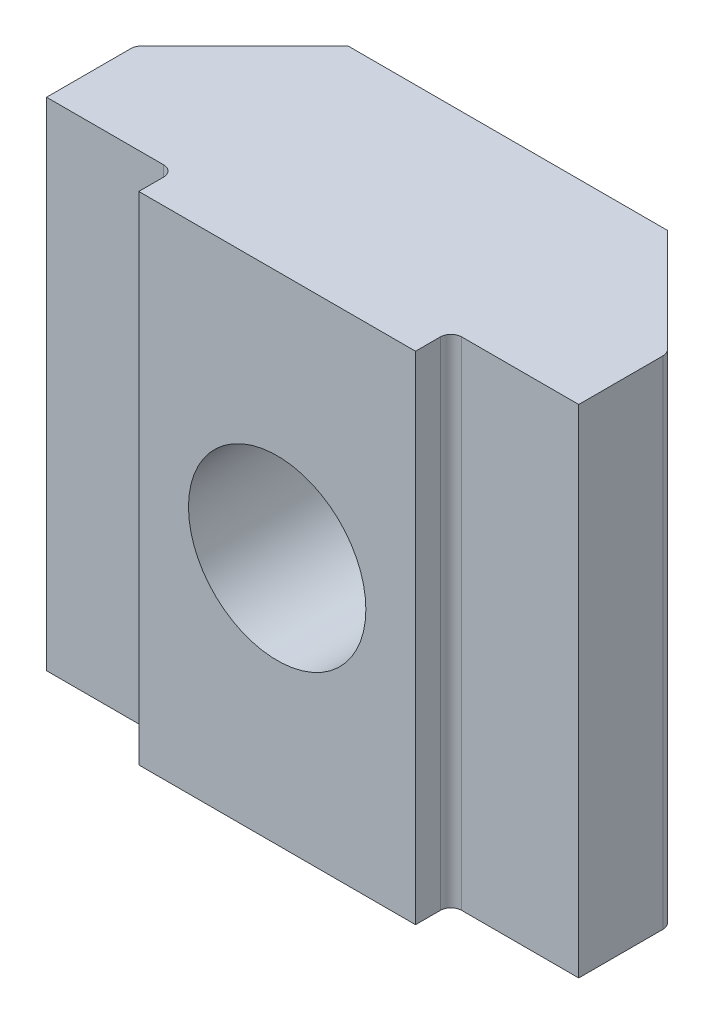
ISO-10303-21;
HEADER;
FILE_DESCRIPTION(('STEP AP214'),'2;1');
FILE_NAME('part.step','',(''),(''),'','','');
FILE_SCHEMA(('AUTOMOTIVE_DESIGN { 1 0 10303 214 1 1 1 1 }'));
ENDSEC;
DATA;
#1=APPLICATION_CONTEXT('core data for automotive mechanical design processes');
#2=APPLICATION_PROTOCOL_DEFINITION('international standard','automotive_design',2000,#1);
#3=PRODUCT_CONTEXT('',#1,'mechanical');
#4=PRODUCT('Part','Part','',(#3));
#5=PRODUCT_RELATED_PRODUCT_CATEGORY('part','',(#4));
#6=PRODUCT_DEFINITION_FORMATION('','',#4);
#7=PRODUCT_DEFINITION_CONTEXT('part definition',#1,'design');
#8=PRODUCT_DEFINITION('design','',#6,#7);
#9=PRODUCT_DEFINITION_SHAPE('','',#8);
#10=(LENGTH_UNIT() NAMED_UNIT(*) SI_UNIT(.MILLI.,.METRE.));
#11=(NAMED_UNIT(*) PLANE_ANGLE_UNIT() SI_UNIT($,.RADIAN.));
#12=(NAMED_UNIT(*) SI_UNIT($,.STERADIAN.) SOLID_ANGLE_UNIT());
#13=UNCERTAINTY_MEASURE_WITH_UNIT(LENGTH_MEASURE(1.E-05),#10,'distance_accuracy_value','');
#14=(GEOMETRIC_REPRESENTATION_CONTEXT(3) GLOBAL_UNCERTAINTY_ASSIGNED_CONTEXT((#13)) GLOBAL_UNIT_ASSIGNED_CONTEXT((#10,
#11,#12)) REPRESENTATION_CONTEXT('',''));
#15=CARTESIAN_POINT('',(0.,0.,0.));
#16=DIRECTION('',(0.,0.,1.));
#17=DIRECTION('',(1.,0.,0.));
#18=AXIS2_PLACEMENT_3D('',#15,#16,#17);
#19=CARTESIAN_POINT('',(0.,0.,0.));
#20=DIRECTION('',(0.,0.,1.));
#21=DIRECTION('',(1.,0.,0.));
#22=AXIS2_PLACEMENT_3D('',#19,#20,#21);
#23=PLANE('',#22);
#24=DIRECTION('',(1.,0.,0.));
#25=VECTOR('',#24,1.);
#26=CARTESIAN_POINT('',(7.5,-7.,0.));
#27=LINE('',#26,#25);
#28=CARTESIAN_POINT('',(-7.5,-7.,0.));
#29=VERTEX_POINT('',#28);
#30=CARTESIAN_POINT('',(-4.2,-7.,0.));
#31=VERTEX_POINT('',#30);
#32=EDGE_CURVE('E213',#29,#31,#27,.T.);
#33=ORIENTED_EDGE('',*,*,#32,.T.);
#34=DIRECTION('',(0.,-1.,0.));
#35=VECTOR('',#34,1.);
#36=CARTESIAN_POINT('',(-4.2,0.,0.));
#37=LINE('',#36,#35);
#38=CARTESIAN_POINT('',(-4.2,7.,0.));
#39=VERTEX_POINT('',#38);
#40=EDGE_CURVE('E240',#31,#39,#37,.F.);
#41=ORIENTED_EDGE('',*,*,#40,.T.);
#42=DIRECTION('',(-1.,0.,0.));
#43=VECTOR('',#42,1.);
#44=CARTESIAN_POINT('',(7.5,7.,0.));
#45=LINE('',#44,#43);
#46=CARTESIAN_POINT('',(-7.5,7.,0.));
#47=VERTEX_POINT('',#46);
#48=EDGE_CURVE('E196',#39,#47,#45,.T.);
#49=ORIENTED_EDGE('',*,*,#48,.T.);
#50=DIRECTION('',(0.,-1.,0.));
#51=VECTOR('',#50,1.);
#52=CARTESIAN_POINT('',(-7.5,-7.,0.));
#53=LINE('',#52,#51);
#54=EDGE_CURVE('E162',#47,#29,#53,.T.);
#55=ORIENTED_EDGE('',*,*,#54,.T.);
#56=EDGE_LOOP('',(#33,#41,#49,#55));
#57=FACE_BOUND('',#56,.T.);
#58=ADVANCED_FACE('F37',(#57),#23,.T.);
#59=CARTESIAN_POINT('',(-7.5,-7.,-5.5));
#60=DIRECTION('',(-1.,0.,0.));
#61=DIRECTION('',(0.,0.,1.));
#62=AXIS2_PLACEMENT_3D('',#59,#60,#61);
#63=PLANE('',#62);
#64=DIRECTION('',(0.,0.,1.));
#65=VECTOR('',#64,1.);
#66=CARTESIAN_POINT('',(-7.5,7.,-5.5));
#67=LINE('',#66,#65);
#68=CARTESIAN_POINT('',(-7.5,7.,-2.37573593128808));
#69=VERTEX_POINT('',#68);
#70=EDGE_CURVE('E182',#69,#47,#67,.T.);
#71=ORIENTED_EDGE('',*,*,#70,.F.);
#72=DIRECTION('',(0.,-1.,0.));
#73=VECTOR('',#72,1.);
#74=CARTESIAN_POINT('',(-7.5,-7.,-2.37573593128808));
#75=LINE('',#74,#73);
#76=CARTESIAN_POINT('',(-7.5,-7.,-2.37573593128808));
#77=VERTEX_POINT('',#76);
#78=EDGE_CURVE('E235',#69,#77,#75,.T.);
#79=ORIENTED_EDGE('',*,*,#78,.T.);
#80=DIRECTION('',(0.,0.,1.));
#81=VECTOR('',#80,1.);
#82=CARTESIAN_POINT('',(-7.5,-7.,-5.5));
#83=LINE('',#82,#81);
#84=EDGE_CURVE('E258',#77,#29,#83,.T.);
#85=ORIENTED_EDGE('',*,*,#84,.T.);
#86=ORIENTED_EDGE('',*,*,#54,.F.);
#87=EDGE_LOOP('',(#71,#79,#85,#86));
#88=FACE_BOUND('',#87,.T.);
#89=ADVANCED_FACE('F257',(#88),#63,.T.);
#90=CARTESIAN_POINT('',(7.5,7.,-5.5));
#91=DIRECTION('',(0.,1.,0.));
#92=DIRECTION('',(-1.,0.,0.));
#93=AXIS2_PLACEMENT_3D('',#90,#91,#92);
#94=PLANE('',#93);
#95=DIRECTION('',(0.,0.,1.));
#96=VECTOR('',#95,1.);
#97=CARTESIAN_POINT('',(7.5,7.,-5.5));
#98=LINE('',#97,#96);
#99=CARTESIAN_POINT('',(7.5,7.,-2.37573593128808));
#100=VERTEX_POINT('',#99);
#101=CARTESIAN_POINT('',(7.5,7.,0.));
#102=VERTEX_POINT('',#101);
#103=EDGE_CURVE('E256',#100,#102,#98,.T.);
#104=ORIENTED_EDGE('',*,*,#103,.F.);
#105=CARTESIAN_POINT('',(7.2,7.,-2.37573593128808));
#106=DIRECTION('',(0.,1.,0.));
#107=DIRECTION('',(-1.,0.,0.));
#108=AXIS2_PLACEMENT_3D('',#105,#106,#107);
#109=CIRCLE('',#108,0.3);
#110=CARTESIAN_POINT('',(7.41213203435596,7.,-2.58786796564404));
#111=VERTEX_POINT('',#110);
#112=EDGE_CURVE('E281',#100,#111,#109,.T.);
#113=ORIENTED_EDGE('',*,*,#112,.T.);
#114=DIRECTION('',(-0.707106781186549,0.,-0.707106781186546));
#115=VECTOR('',#114,1.);
#116=CARTESIAN_POINT('',(6.,7.,-4.));
#117=LINE('',#116,#115);
#118=CARTESIAN_POINT('',(4.49999999999999,7.,-5.5));
#119=VERTEX_POINT('',#118);
#120=EDGE_CURVE('E181',#111,#119,#117,.T.);
#121=ORIENTED_EDGE('',*,*,#120,.T.);
#122=DIRECTION('',(-1.,0.,0.));
#123=VECTOR('',#122,1.);
#124=CARTESIAN_POINT('',(7.5,7.,-5.5));
#125=LINE('',#124,#123);
#126=CARTESIAN_POINT('',(-4.49999999999999,7.,-5.5));
#127=VERTEX_POINT('',#126);
#128=EDGE_CURVE('E260',#119,#127,#125,.T.);
#129=ORIENTED_EDGE('',*,*,#128,.T.);
#130=DIRECTION('',(-0.707106781186549,0.,0.707106781186546));
#131=VECTOR('',#130,1.);
#132=CARTESIAN_POINT('',(1.50000000000003,7.,-11.5));
#133=LINE('',#132,#131);
#134=CARTESIAN_POINT('',(-7.41213203435596,7.,-2.58786796564404));
#135=VERTEX_POINT('',#134);
#136=EDGE_CURVE('E178',#127,#135,#133,.T.);
#137=ORIENTED_EDGE('',*,*,#136,.T.);
#138=CARTESIAN_POINT('',(-7.2,7.,-2.37573593128808));
#139=DIRECTION('',(0.,1.,0.));
#140=DIRECTION('',(-1.,0.,0.));
#141=AXIS2_PLACEMENT_3D('',#138,#139,#140);
#142=CIRCLE('',#141,0.3);
#143=EDGE_CURVE('E195',#135,#69,#142,.T.);
#144=ORIENTED_EDGE('',*,*,#143,.T.);
#145=ORIENTED_EDGE('',*,*,#70,.T.);
#146=ORIENTED_EDGE('',*,*,#48,.F.);
#147=CARTESIAN_POINT('',(-4.2,7.,0.3));
#148=DIRECTION('',(0.,1.,0.));
#149=DIRECTION('',(-1.,0.,0.));
#150=AXIS2_PLACEMENT_3D('',#147,#148,#149);
#151=CIRCLE('',#150,0.3);
#152=CARTESIAN_POINT('',(-3.9,7.,0.3));
#153=VERTEX_POINT('',#152);
#154=EDGE_CURVE('E11',#39,#153,#151,.F.);
#155=ORIENTED_EDGE('',*,*,#154,.T.);
#156=DIRECTION('',(0.,0.,-1.));
#157=VECTOR('',#156,1.);
#158=CARTESIAN_POINT('',(-3.9,7.,1.));
#159=LINE('',#158,#157);
#160=CARTESIAN_POINT('',(-3.9,7.,1.));
#161=VERTEX_POINT('',#160);
#162=EDGE_CURVE('E174',#161,#153,#159,.T.);
#163=ORIENTED_EDGE('',*,*,#162,.F.);
#164=DIRECTION('',(-1.,0.,0.));
#165=VECTOR('',#164,1.);
#166=CARTESIAN_POINT('',(3.9,7.,1.));
#167=LINE('',#166,#165);
#168=CARTESIAN_POINT('',(3.9,7.,1.));
#169=VERTEX_POINT('',#168);
#170=EDGE_CURVE('E152',#169,#161,#167,.T.);
#171=ORIENTED_EDGE('',*,*,#170,.F.);
#172=DIRECTION('',(0.,0.,-1.));
#173=VECTOR('',#172,1.);
#174=CARTESIAN_POINT('',(3.9,7.,1.));
#175=LINE('',#174,#173);
#176=CARTESIAN_POINT('',(3.9,7.,0.3));
#177=VERTEX_POINT('',#176);
#178=EDGE_CURVE('E167',#169,#177,#175,.T.);
#179=ORIENTED_EDGE('',*,*,#178,.T.);
#180=CARTESIAN_POINT('',(4.2,7.,0.3));
#181=DIRECTION('',(0.,1.,0.));
#182=DIRECTION('',(-1.,0.,0.));
#183=AXIS2_PLACEMENT_3D('',#180,#181,#182);
#184=CIRCLE('',#183,0.3);
#185=CARTESIAN_POINT('',(4.2,7.,0.));
#186=VERTEX_POINT('',#185);
#187=EDGE_CURVE('E223',#177,#186,#184,.F.);
#188=ORIENTED_EDGE('',*,*,#187,.T.);
#189=EDGE_CURVE('E199',#102,#186,#45,.T.);
#190=ORIENTED_EDGE('',*,*,#189,.F.);
#191=EDGE_LOOP('',(#104,#113,#121,#129,#137,#144,#145,#146,#155,#163,#171,#179,#188,#190));
#192=FACE_BOUND('',#191,.T.);
#193=ADVANCED_FACE('F221',(#192),#94,.T.);
#194=CARTESIAN_POINT('',(7.5,-7.,-5.5));
#195=DIRECTION('',(1.,0.,0.));
#196=DIRECTION('',(0.,0.,-1.));
#197=AXIS2_PLACEMENT_3D('',#194,#195,#196);
#198=PLANE('',#197);
#199=DIRECTION('',(0.,0.,1.));
#200=VECTOR('',#199,1.);
#201=CARTESIAN_POINT('',(7.5,-7.,-5.5));
#202=LINE('',#201,#200);
#203=CARTESIAN_POINT('',(7.5,-7.,-2.37573593128808));
#204=VERTEX_POINT('',#203);
#205=CARTESIAN_POINT('',(7.5,-7.,0.));
#206=VERTEX_POINT('',#205);
#207=EDGE_CURVE('E259',#204,#206,#202,.T.);
#208=ORIENTED_EDGE('',*,*,#207,.F.);
#209=DIRECTION('',(0.,1.,0.));
#210=VECTOR('',#209,1.);
#211=CARTESIAN_POINT('',(7.5,-7.,-2.37573593128808));
#212=LINE('',#211,#210);
#213=EDGE_CURVE('E192',#204,#100,#212,.T.);
#214=ORIENTED_EDGE('',*,*,#213,.T.);
#215=ORIENTED_EDGE('',*,*,#103,.T.);
#216=DIRECTION('',(0.,1.,0.));
#217=VECTOR('',#216,1.);
#218=CARTESIAN_POINT('',(7.5,-7.,0.));
#219=LINE('',#218,#217);
#220=EDGE_CURVE('E200',#206,#102,#219,.T.);
#221=ORIENTED_EDGE('',*,*,#220,.F.);
#222=EDGE_LOOP('',(#208,#214,#215,#221));
#223=FACE_BOUND('',#222,.T.);
#224=ADVANCED_FACE('F269',(#223),#198,.T.);
#225=CARTESIAN_POINT('',(7.5,-7.,-5.5));
#226=DIRECTION('',(0.,-1.,0.));
#227=DIRECTION('',(1.,0.,0.));
#228=AXIS2_PLACEMENT_3D('',#225,#226,#227);
#229=PLANE('',#228);
#230=DIRECTION('',(0.707106781186549,0.,0.707106781186546));
#231=VECTOR('',#230,1.);
#232=CARTESIAN_POINT('',(6.,-7.,-4.));
#233=LINE('',#232,#231);
#234=CARTESIAN_POINT('',(4.49999999999999,-7.,-5.5));
#235=VERTEX_POINT('',#234);
#236=CARTESIAN_POINT('',(7.41213203435596,-7.,-2.58786796564404));
#237=VERTEX_POINT('',#236);
#238=EDGE_CURVE('E190',#235,#237,#233,.T.);
#239=ORIENTED_EDGE('',*,*,#238,.T.);
#240=CARTESIAN_POINT('',(7.2,-7.,-2.37573593128808));
#241=DIRECTION('',(0.,-1.,0.));
#242=DIRECTION('',(1.,0.,0.));
#243=AXIS2_PLACEMENT_3D('',#240,#241,#242);
#244=CIRCLE('',#243,0.3);
#245=EDGE_CURVE('E277',#237,#204,#244,.T.);
#246=ORIENTED_EDGE('',*,*,#245,.T.);
#247=ORIENTED_EDGE('',*,*,#207,.T.);
#248=CARTESIAN_POINT('',(4.2,-7.,0.));
#249=VERTEX_POINT('',#248);
#250=EDGE_CURVE('E165',#249,#206,#27,.T.);
#251=ORIENTED_EDGE('',*,*,#250,.F.);
#252=CARTESIAN_POINT('',(4.2,-7.,0.3));
#253=DIRECTION('',(0.,-1.,0.));
#254=DIRECTION('',(1.,0.,0.));
#255=AXIS2_PLACEMENT_3D('',#252,#253,#254);
#256=CIRCLE('',#255,0.3);
#257=CARTESIAN_POINT('',(3.9,-7.,0.3));
#258=VERTEX_POINT('',#257);
#259=EDGE_CURVE('E243',#249,#258,#256,.F.);
#260=ORIENTED_EDGE('',*,*,#259,.T.);
#261=DIRECTION('',(0.,0.,-1.));
#262=VECTOR('',#261,1.);
#263=CARTESIAN_POINT('',(3.9,-7.,1.));
#264=LINE('',#263,#262);
#265=CARTESIAN_POINT('',(3.9,-7.,1.));
#266=VERTEX_POINT('',#265);
#267=EDGE_CURVE('E143',#266,#258,#264,.T.);
#268=ORIENTED_EDGE('',*,*,#267,.F.);
#269=DIRECTION('',(1.,0.,0.));
#270=VECTOR('',#269,1.);
#271=CARTESIAN_POINT('',(3.9,-7.,1.));
#272=LINE('',#271,#270);
#273=CARTESIAN_POINT('',(-3.9,-7.,1.));
#274=VERTEX_POINT('',#273);
#275=EDGE_CURVE('E136',#274,#266,#272,.T.);
#276=ORIENTED_EDGE('',*,*,#275,.F.);
#277=DIRECTION('',(0.,0.,-1.));
#278=VECTOR('',#277,1.);
#279=CARTESIAN_POINT('',(-3.9,-7.,1.));
#280=LINE('',#279,#278);
#281=CARTESIAN_POINT('',(-3.9,-7.,0.3));
#282=VERTEX_POINT('',#281);
#283=EDGE_CURVE('E141',#274,#282,#280,.T.);
#284=ORIENTED_EDGE('',*,*,#283,.T.);
#285=CARTESIAN_POINT('',(-4.2,-7.,0.3));
#286=DIRECTION('',(0.,-1.,0.));
#287=DIRECTION('',(1.,0.,0.));
#288=AXIS2_PLACEMENT_3D('',#285,#286,#287);
#289=CIRCLE('',#288,0.3);
#290=EDGE_CURVE('E45',#282,#31,#289,.F.);
#291=ORIENTED_EDGE('',*,*,#290,.T.);
#292=ORIENTED_EDGE('',*,*,#32,.F.);
#293=ORIENTED_EDGE('',*,*,#84,.F.);
#294=CARTESIAN_POINT('',(-7.2,-7.,-2.37573593128808));
#295=DIRECTION('',(0.,-1.,0.));
#296=DIRECTION('',(1.,0.,0.));
#297=AXIS2_PLACEMENT_3D('',#294,#295,#296);
#298=CIRCLE('',#297,0.3);
#299=CARTESIAN_POINT('',(-7.41213203435596,-7.,-2.58786796564404));
#300=VERTEX_POINT('',#299);
#301=EDGE_CURVE('E52',#77,#300,#298,.T.);
#302=ORIENTED_EDGE('',*,*,#301,.T.);
#303=DIRECTION('',(0.707106781186549,0.,-0.707106781186546));
#304=VECTOR('',#303,1.);
#305=CARTESIAN_POINT('',(1.50000000000003,-7.,-11.5));
#306=LINE('',#305,#304);
#307=CARTESIAN_POINT('',(-4.49999999999999,-7.,-5.5));
#308=VERTEX_POINT('',#307);
#309=EDGE_CURVE('E188',#300,#308,#306,.T.);
#310=ORIENTED_EDGE('',*,*,#309,.T.);
#311=DIRECTION('',(1.,0.,0.));
#312=VECTOR('',#311,1.);
#313=CARTESIAN_POINT('',(7.5,-7.,-5.5));
#314=LINE('',#313,#312);
#315=EDGE_CURVE('E212',#308,#235,#314,.T.);
#316=ORIENTED_EDGE('',*,*,#315,.T.);
#317=EDGE_LOOP('',(#239,#246,#247,#251,#260,#268,#276,#284,#291,#292,#293,#302,#310,#316));
#318=FACE_BOUND('',#317,.T.);
#319=ADVANCED_FACE('F139',(#318),#229,.T.);
#320=CARTESIAN_POINT('',(0.,0.,-5.5));
#321=DIRECTION('',(0.,0.,1.));
#322=DIRECTION('',(1.,0.,0.));
#323=AXIS2_PLACEMENT_3D('',#320,#321,#322);
#324=PLANE('',#323);
#325=CARTESIAN_POINT('',(0.,0.,-5.5));
#326=DIRECTION('',(0.,0.,-1.));
#327=DIRECTION('',(-1.,0.,0.));
#328=AXIS2_PLACEMENT_3D('',#325,#326,#327);
#329=CIRCLE('',#328,2.49999999999999);
#330=CARTESIAN_POINT('',(-2.49999999999999,0.,-5.5));
#331=VERTEX_POINT('',#330);
#332=EDGE_CURVE('E296',#331,#331,#329,.T.);
#333=ORIENTED_EDGE('',*,*,#332,.F.);
#334=EDGE_LOOP('',(#333));
#335=FACE_BOUND('',#334,.T.);
#336=ORIENTED_EDGE('',*,*,#128,.F.);
#337=DIRECTION('',(0.,-1.,0.));
#338=VECTOR('',#337,1.);
#339=CARTESIAN_POINT('',(4.49999999999999,-7.,-5.5));
#340=LINE('',#339,#338);
#341=EDGE_CURVE('E186',#119,#235,#340,.T.);
#342=ORIENTED_EDGE('',*,*,#341,.T.);
#343=ORIENTED_EDGE('',*,*,#315,.F.);
#344=DIRECTION('',(0.,1.,0.));
#345=VECTOR('',#344,1.);
#346=CARTESIAN_POINT('',(-4.49999999999999,7.,-5.5));
#347=LINE('',#346,#345);
#348=EDGE_CURVE('E184',#308,#127,#347,.T.);
#349=ORIENTED_EDGE('',*,*,#348,.T.);
#350=EDGE_LOOP('',(#336,#342,#343,#349));
#351=FACE_BOUND('',#350,.T.);
#352=ADVANCED_FACE('F302',(#335,#351),#324,.F.);
#353=ORIENTED_EDGE('',*,*,#189,.T.);
#354=DIRECTION('',(0.,1.,0.));
#355=VECTOR('',#354,1.);
#356=CARTESIAN_POINT('',(4.2,0.,0.));
#357=LINE('',#356,#355);
#358=EDGE_CURVE('E231',#186,#249,#357,.F.);
#359=ORIENTED_EDGE('',*,*,#358,.T.);
#360=ORIENTED_EDGE('',*,*,#250,.T.);
#361=ORIENTED_EDGE('',*,*,#220,.T.);
#362=EDGE_LOOP('',(#353,#359,#360,#361));
#363=FACE_BOUND('',#362,.T.);
#364=ADVANCED_FACE('F272',(#363),#23,.T.);
#365=CARTESIAN_POINT('',(-3.9,-7.,1.));
#366=DIRECTION('',(1.,0.,0.));
#367=DIRECTION('',(0.,0.,-1.));
#368=AXIS2_PLACEMENT_3D('',#365,#366,#367);
#369=PLANE('',#368);
#370=ORIENTED_EDGE('',*,*,#162,.T.);
#371=DIRECTION('',(0.,-1.,0.));
#372=VECTOR('',#371,1.);
#373=CARTESIAN_POINT('',(-3.9,-7.,0.3));
#374=LINE('',#373,#372);
#375=EDGE_CURVE('E161',#153,#282,#374,.T.);
#376=ORIENTED_EDGE('',*,*,#375,.T.);
#377=ORIENTED_EDGE('',*,*,#283,.F.);
#378=DIRECTION('',(0.,-1.,0.));
#379=VECTOR('',#378,1.);
#380=CARTESIAN_POINT('',(-3.9,-7.,1.));
#381=LINE('',#380,#379);
#382=EDGE_CURVE('E147',#161,#274,#381,.T.);
#383=ORIENTED_EDGE('',*,*,#382,.F.);
#384=EDGE_LOOP('',(#370,#376,#377,#383));
#385=FACE_BOUND('',#384,.T.);
#386=ADVANCED_FACE('F159',(#385),#369,.F.);
#387=CARTESIAN_POINT('',(3.9,-7.,1.));
#388=DIRECTION('',(-1.,0.,0.));
#389=DIRECTION('',(0.,0.,1.));
#390=AXIS2_PLACEMENT_3D('',#387,#388,#389);
#391=PLANE('',#390);
#392=ORIENTED_EDGE('',*,*,#267,.T.);
#393=DIRECTION('',(0.,1.,0.));
#394=VECTOR('',#393,1.);
#395=CARTESIAN_POINT('',(3.9,-7.,0.3));
#396=LINE('',#395,#394);
#397=EDGE_CURVE('E228',#258,#177,#396,.T.);
#398=ORIENTED_EDGE('',*,*,#397,.T.);
#399=ORIENTED_EDGE('',*,*,#178,.F.);
#400=DIRECTION('',(0.,1.,0.));
#401=VECTOR('',#400,1.);
#402=CARTESIAN_POINT('',(3.9,-7.,1.));
#403=LINE('',#402,#401);
#404=EDGE_CURVE('E146',#266,#169,#403,.T.);
#405=ORIENTED_EDGE('',*,*,#404,.F.);
#406=EDGE_LOOP('',(#392,#398,#399,#405));
#407=FACE_BOUND('',#406,.T.);
#408=ADVANCED_FACE('F226',(#407),#391,.F.);
#409=CARTESIAN_POINT('',(0.,0.,1.));
#410=DIRECTION('',(0.,0.,1.));
#411=DIRECTION('',(1.,0.,0.));
#412=AXIS2_PLACEMENT_3D('',#409,#410,#411);
#413=PLANE('',#412);
#414=CARTESIAN_POINT('',(0.,0.,1.));
#415=DIRECTION('',(0.,0.,1.));
#416=DIRECTION('',(1.,0.,0.));
#417=AXIS2_PLACEMENT_3D('',#414,#415,#416);
#418=CIRCLE('',#417,2.49999999999999);
#419=CARTESIAN_POINT('',(2.49999999999999,0.,1.));
#420=VERTEX_POINT('',#419);
#421=EDGE_CURVE('E156',#420,#420,#418,.T.);
#422=ORIENTED_EDGE('',*,*,#421,.F.);
#423=EDGE_LOOP('',(#422));
#424=FACE_BOUND('',#423,.T.);
#425=ORIENTED_EDGE('',*,*,#382,.T.);
#426=ORIENTED_EDGE('',*,*,#275,.T.);
#427=ORIENTED_EDGE('',*,*,#404,.T.);
#428=ORIENTED_EDGE('',*,*,#170,.T.);
#429=EDGE_LOOP('',(#425,#426,#427,#428));
#430=FACE_BOUND('',#429,.T.);
#431=ADVANCED_FACE('F150',(#424,#430),#413,.T.);
#432=CARTESIAN_POINT('',(0.,0.,-5.5));
#433=DIRECTION('',(0.,0.,-1.));
#434=DIRECTION('',(-1.,0.,0.));
#435=AXIS2_PLACEMENT_3D('',#432,#433,#434);
#436=CYLINDRICAL_SURFACE('',#435,2.49999999999999);
#437=ORIENTED_EDGE('',*,*,#421,.T.);
#438=EDGE_LOOP('',(#437));
#439=FACE_BOUND('',#438,.T.);
#440=ORIENTED_EDGE('',*,*,#332,.T.);
#441=EDGE_LOOP('',(#440));
#442=FACE_BOUND('',#441,.T.);
#443=ADVANCED_FACE('F300',(#439,#442),#436,.F.);
#444=CARTESIAN_POINT('',(7.5,-7.,-2.5));
#445=DIRECTION('',(0.707106781186546,0.,-0.707106781186549));
#446=DIRECTION('',(0.,-1.,0.));
#447=AXIS2_PLACEMENT_3D('',#444,#445,#446);
#448=PLANE('',#447);
#449=ORIENTED_EDGE('',*,*,#120,.F.);
#450=DIRECTION('',(0.,1.,0.));
#451=VECTOR('',#450,1.);
#452=CARTESIAN_POINT('',(7.41213203435596,-7.,-2.58786796564404));
#453=LINE('',#452,#451);
#454=EDGE_CURVE('E282',#111,#237,#453,.F.);
#455=ORIENTED_EDGE('',*,*,#454,.T.);
#456=ORIENTED_EDGE('',*,*,#238,.F.);
#457=ORIENTED_EDGE('',*,*,#341,.F.);
#458=EDGE_LOOP('',(#449,#455,#456,#457));
#459=FACE_BOUND('',#458,.T.);
#460=ADVANCED_FACE('F313',(#459),#448,.T.);
#461=CARTESIAN_POINT('',(-7.5,-7.,-2.5));
#462=DIRECTION('',(-0.707106781186546,0.,-0.707106781186549));
#463=DIRECTION('',(0.,1.,0.));
#464=AXIS2_PLACEMENT_3D('',#461,#462,#463);
#465=PLANE('',#464);
#466=ORIENTED_EDGE('',*,*,#309,.F.);
#467=DIRECTION('',(0.,-1.,0.));
#468=VECTOR('',#467,1.);
#469=CARTESIAN_POINT('',(-7.41213203435596,-7.,-2.58786796564404));
#470=LINE('',#469,#468);
#471=EDGE_CURVE('E232',#300,#135,#470,.F.);
#472=ORIENTED_EDGE('',*,*,#471,.T.);
#473=ORIENTED_EDGE('',*,*,#136,.F.);
#474=ORIENTED_EDGE('',*,*,#348,.F.);
#475=EDGE_LOOP('',(#466,#472,#473,#474));
#476=FACE_BOUND('',#475,.T.);
#477=ADVANCED_FACE('F315',(#476),#465,.T.);
#478=CARTESIAN_POINT('',(7.2,-7.,-2.37573593128808));
#479=DIRECTION('',(0.,1.,0.));
#480=DIRECTION('',(0.,0.,1.));
#481=AXIS2_PLACEMENT_3D('',#478,#479,#480);
#482=CYLINDRICAL_SURFACE('',#481,0.3);
#483=ORIENTED_EDGE('',*,*,#245,.F.);
#484=ORIENTED_EDGE('',*,*,#454,.F.);
#485=ORIENTED_EDGE('',*,*,#112,.F.);
#486=ORIENTED_EDGE('',*,*,#213,.F.);
#487=EDGE_LOOP('',(#483,#484,#485,#486));
#488=FACE_BOUND('',#487,.T.);
#489=ADVANCED_FACE('F279',(#488),#482,.T.);
#490=CARTESIAN_POINT('',(-7.2,-7.,-2.37573593128808));
#491=DIRECTION('',(0.,-1.,0.));
#492=DIRECTION('',(0.,0.,-1.));
#493=AXIS2_PLACEMENT_3D('',#490,#491,#492);
#494=CYLINDRICAL_SURFACE('',#493,0.3);
#495=ORIENTED_EDGE('',*,*,#143,.F.);
#496=ORIENTED_EDGE('',*,*,#471,.F.);
#497=ORIENTED_EDGE('',*,*,#301,.F.);
#498=ORIENTED_EDGE('',*,*,#78,.F.);
#499=EDGE_LOOP('',(#495,#496,#497,#498));
#500=FACE_BOUND('',#499,.T.);
#501=ADVANCED_FACE('F316',(#500),#494,.T.);
#502=CARTESIAN_POINT('',(4.2,-7.,0.3));
#503=DIRECTION('',(0.,1.,0.));
#504=DIRECTION('',(0.,0.,1.));
#505=AXIS2_PLACEMENT_3D('',#502,#503,#504);
#506=CYLINDRICAL_SURFACE('',#505,0.3);
#507=ORIENTED_EDGE('',*,*,#259,.F.);
#508=ORIENTED_EDGE('',*,*,#358,.F.);
#509=ORIENTED_EDGE('',*,*,#187,.F.);
#510=ORIENTED_EDGE('',*,*,#397,.F.);
#511=EDGE_LOOP('',(#507,#508,#509,#510));
#512=FACE_BOUND('',#511,.T.);
#513=ADVANCED_FACE('F318',(#512),#506,.F.);
#514=CARTESIAN_POINT('',(-4.2,-7.,0.3));
#515=DIRECTION('',(0.,-1.,0.));
#516=DIRECTION('',(0.,0.,-1.));
#517=AXIS2_PLACEMENT_3D('',#514,#515,#516);
#518=CYLINDRICAL_SURFACE('',#517,0.3);
#519=ORIENTED_EDGE('',*,*,#154,.F.);
#520=ORIENTED_EDGE('',*,*,#40,.F.);
#521=ORIENTED_EDGE('',*,*,#290,.F.);
#522=ORIENTED_EDGE('',*,*,#375,.F.);
#523=EDGE_LOOP('',(#519,#520,#521,#522));
#524=FACE_BOUND('',#523,.T.);
#525=ADVANCED_FACE('F39',(#524),#518,.F.);
#526=CLOSED_SHELL('',(#58,#89,#193,#224,#319,#352,#364,#386,#408,#431,#443,#460,#477,#489,#501,
#513,#525));
#527=MANIFOLD_SOLID_BREP('B2',#526);
#528=ADVANCED_BREP_SHAPE_REPRESENTATION('',(#18,#527),#14);
#529=SHAPE_DEFINITION_REPRESENTATION(#9,#528);
ENDSEC;
END-ISO-10303-21;
